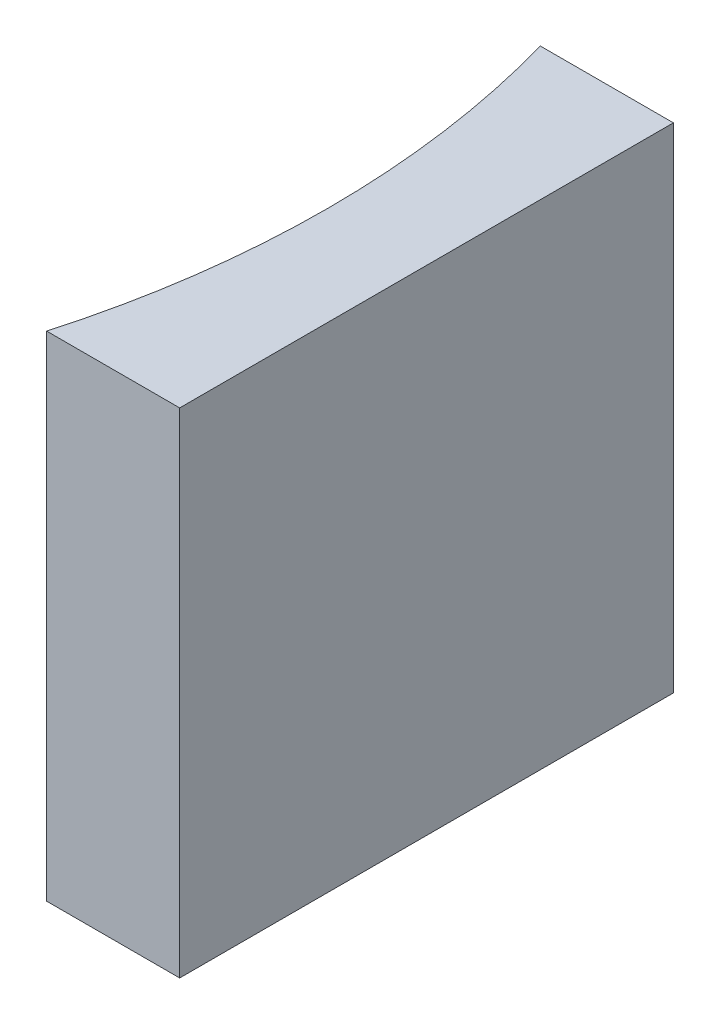
ISO-10303-21;
HEADER;
FILE_DESCRIPTION(('STEP AP214'),'2;1');
FILE_NAME('part.step','',(''),(''),'','','');
FILE_SCHEMA(('AUTOMOTIVE_DESIGN { 1 0 10303 214 1 1 1 1 }'));
ENDSEC;
DATA;
#1=APPLICATION_CONTEXT('core data for automotive mechanical design processes');
#2=APPLICATION_PROTOCOL_DEFINITION('international standard','automotive_design',2000,#1);
#3=PRODUCT_CONTEXT('',#1,'mechanical');
#4=PRODUCT('Part','Part','',(#3));
#5=PRODUCT_RELATED_PRODUCT_CATEGORY('part','',(#4));
#6=PRODUCT_DEFINITION_FORMATION('','',#4);
#7=PRODUCT_DEFINITION_CONTEXT('part definition',#1,'design');
#8=PRODUCT_DEFINITION('design','',#6,#7);
#9=PRODUCT_DEFINITION_SHAPE('','',#8);
#10=(LENGTH_UNIT() NAMED_UNIT(*) SI_UNIT(.MILLI.,.METRE.));
#11=(NAMED_UNIT(*) PLANE_ANGLE_UNIT() SI_UNIT($,.RADIAN.));
#12=(NAMED_UNIT(*) SI_UNIT($,.STERADIAN.) SOLID_ANGLE_UNIT());
#13=UNCERTAINTY_MEASURE_WITH_UNIT(LENGTH_MEASURE(1.E-05),#10,'distance_accuracy_value','');
#14=(GEOMETRIC_REPRESENTATION_CONTEXT(3) GLOBAL_UNCERTAINTY_ASSIGNED_CONTEXT((#13)) GLOBAL_UNIT_ASSIGNED_CONTEXT((#10,
#11,#12)) REPRESENTATION_CONTEXT('',''));
#15=CARTESIAN_POINT('',(0.,0.,0.));
#16=DIRECTION('',(0.,0.,1.));
#17=DIRECTION('',(1.,0.,0.));
#18=AXIS2_PLACEMENT_3D('',#15,#16,#17);
#19=CARTESIAN_POINT('',(0.,10.,0.));
#20=DIRECTION('',(0.,0.,1.));
#21=DIRECTION('',(1.,0.,0.));
#22=AXIS2_PLACEMENT_3D('',#19,#20,#21);
#23=PLANE('',#22);
#24=DIRECTION('',(-1.,0.,0.));
#25=VECTOR('',#24,1.);
#26=CARTESIAN_POINT('',(0.,0.,0.));
#27=LINE('',#26,#25);
#28=CARTESIAN_POINT('',(0.,0.,0.));
#29=VERTEX_POINT('',#28);
#30=CARTESIAN_POINT('',(-2.69551702886011,0.,0.));
#31=VERTEX_POINT('',#30);
#32=EDGE_CURVE('E98',#29,#31,#27,.T.);
#33=ORIENTED_EDGE('',*,*,#32,.T.);
#34=DIRECTION('',(0.,-1.,0.));
#35=VECTOR('',#34,1.);
#36=CARTESIAN_POINT('',(-2.69551702886011,10.,0.));
#37=LINE('',#36,#35);
#38=CARTESIAN_POINT('',(-2.69551702886011,10.,0.));
#39=VERTEX_POINT('',#38);
#40=EDGE_CURVE('E11',#39,#31,#37,.T.);
#41=ORIENTED_EDGE('',*,*,#40,.F.);
#42=DIRECTION('',(-1.,0.,0.));
#43=VECTOR('',#42,1.);
#44=CARTESIAN_POINT('',(0.,10.,0.));
#45=LINE('',#44,#43);
#46=CARTESIAN_POINT('',(0.,10.,0.));
#47=VERTEX_POINT('',#46);
#48=EDGE_CURVE('E86',#47,#39,#45,.T.);
#49=ORIENTED_EDGE('',*,*,#48,.F.);
#50=DIRECTION('',(0.,-1.,0.));
#51=VECTOR('',#50,1.);
#52=CARTESIAN_POINT('',(0.,10.,0.));
#53=LINE('',#52,#51);
#54=EDGE_CURVE('E94',#47,#29,#53,.T.);
#55=ORIENTED_EDGE('',*,*,#54,.T.);
#56=EDGE_LOOP('',(#33,#41,#49,#55));
#57=FACE_BOUND('',#56,.T.);
#58=ADVANCED_FACE('F35',(#57),#23,.F.);
#59=CARTESIAN_POINT('',(-20.32,10.,5.));
#60=DIRECTION('',(0.,-1.,0.));
#61=DIRECTION('',(0.,0.,-1.));
#62=AXIS2_PLACEMENT_3D('',#59,#60,#61);
#63=CYLINDRICAL_SURFACE('',#62,18.32);
#64=CARTESIAN_POINT('',(-20.32,0.,5.));
#65=DIRECTION('',(0.,-1.,0.));
#66=DIRECTION('',(0.,0.,1.));
#67=AXIS2_PLACEMENT_3D('',#64,#65,#66);
#68=CIRCLE('',#67,18.32);
#69=CARTESIAN_POINT('',(-2.69551702886011,0.,10.));
#70=VERTEX_POINT('',#69);
#71=EDGE_CURVE('E90',#31,#70,#68,.T.);
#72=ORIENTED_EDGE('',*,*,#71,.T.);
#73=DIRECTION('',(0.,-1.,0.));
#74=VECTOR('',#73,1.);
#75=CARTESIAN_POINT('',(-2.69551702886011,10.,10.));
#76=LINE('',#75,#74);
#77=CARTESIAN_POINT('',(-2.69551702886011,10.,10.));
#78=VERTEX_POINT('',#77);
#79=EDGE_CURVE('E43',#78,#70,#76,.T.);
#80=ORIENTED_EDGE('',*,*,#79,.F.);
#81=CARTESIAN_POINT('',(-20.32,10.,5.));
#82=DIRECTION('',(0.,-1.,0.));
#83=DIRECTION('',(0.,0.,1.));
#84=AXIS2_PLACEMENT_3D('',#81,#82,#83);
#85=CIRCLE('',#84,18.32);
#86=EDGE_CURVE('E81',#39,#78,#85,.T.);
#87=ORIENTED_EDGE('',*,*,#86,.F.);
#88=ORIENTED_EDGE('',*,*,#40,.T.);
#89=EDGE_LOOP('',(#72,#80,#87,#88));
#90=FACE_BOUND('',#89,.T.);
#91=ADVANCED_FACE('F89',(#90),#63,.F.);
#92=CARTESIAN_POINT('',(0.,10.,10.));
#93=DIRECTION('',(0.,0.,-1.));
#94=DIRECTION('',(-1.,0.,0.));
#95=AXIS2_PLACEMENT_3D('',#92,#93,#94);
#96=PLANE('',#95);
#97=DIRECTION('',(1.,0.,0.));
#98=VECTOR('',#97,1.);
#99=CARTESIAN_POINT('',(0.,0.,10.));
#100=LINE('',#99,#98);
#101=CARTESIAN_POINT('',(0.,0.,10.));
#102=VERTEX_POINT('',#101);
#103=EDGE_CURVE('E68',#70,#102,#100,.T.);
#104=ORIENTED_EDGE('',*,*,#103,.T.);
#105=DIRECTION('',(0.,-1.,0.));
#106=VECTOR('',#105,1.);
#107=CARTESIAN_POINT('',(0.,10.,10.));
#108=LINE('',#107,#106);
#109=CARTESIAN_POINT('',(0.,10.,10.));
#110=VERTEX_POINT('',#109);
#111=EDGE_CURVE('E91',#110,#102,#108,.T.);
#112=ORIENTED_EDGE('',*,*,#111,.F.);
#113=DIRECTION('',(1.,0.,0.));
#114=VECTOR('',#113,1.);
#115=CARTESIAN_POINT('',(0.,10.,10.));
#116=LINE('',#115,#114);
#117=EDGE_CURVE('E84',#78,#110,#116,.T.);
#118=ORIENTED_EDGE('',*,*,#117,.F.);
#119=ORIENTED_EDGE('',*,*,#79,.T.);
#120=EDGE_LOOP('',(#104,#112,#118,#119));
#121=FACE_BOUND('',#120,.T.);
#122=ADVANCED_FACE('F92',(#121),#96,.F.);
#123=CARTESIAN_POINT('',(0.,10.,0.));
#124=DIRECTION('',(-1.,0.,0.));
#125=DIRECTION('',(0.,0.,1.));
#126=AXIS2_PLACEMENT_3D('',#123,#124,#125);
#127=PLANE('',#126);
#128=DIRECTION('',(0.,0.,-1.));
#129=VECTOR('',#128,1.);
#130=CARTESIAN_POINT('',(0.,0.,0.));
#131=LINE('',#130,#129);
#132=EDGE_CURVE('E74',#102,#29,#131,.T.);
#133=ORIENTED_EDGE('',*,*,#132,.T.);
#134=ORIENTED_EDGE('',*,*,#54,.F.);
#135=DIRECTION('',(0.,0.,-1.));
#136=VECTOR('',#135,1.);
#137=CARTESIAN_POINT('',(0.,10.,0.));
#138=LINE('',#137,#136);
#139=EDGE_CURVE('E51',#110,#47,#138,.T.);
#140=ORIENTED_EDGE('',*,*,#139,.F.);
#141=ORIENTED_EDGE('',*,*,#111,.T.);
#142=EDGE_LOOP('',(#133,#134,#140,#141));
#143=FACE_BOUND('',#142,.T.);
#144=ADVANCED_FACE('F105',(#143),#127,.F.);
#145=CARTESIAN_POINT('',(-20.32,10.,5.));
#146=DIRECTION('',(0.,1.,0.));
#147=DIRECTION('',(0.,0.,1.));
#148=AXIS2_PLACEMENT_3D('',#145,#146,#147);
#149=PLANE('',#148);
#150=ORIENTED_EDGE('',*,*,#48,.T.);
#151=ORIENTED_EDGE('',*,*,#86,.T.);
#152=ORIENTED_EDGE('',*,*,#117,.T.);
#153=ORIENTED_EDGE('',*,*,#139,.T.);
#154=EDGE_LOOP('',(#150,#151,#152,#153));
#155=FACE_BOUND('',#154,.T.);
#156=ADVANCED_FACE('F82',(#155),#149,.T.);
#157=CARTESIAN_POINT('',(-20.32,0.,5.));
#158=DIRECTION('',(0.,1.,0.));
#159=DIRECTION('',(0.,0.,1.));
#160=AXIS2_PLACEMENT_3D('',#157,#158,#159);
#161=PLANE('',#160);
#162=ORIENTED_EDGE('',*,*,#32,.F.);
#163=ORIENTED_EDGE('',*,*,#132,.F.);
#164=ORIENTED_EDGE('',*,*,#103,.F.);
#165=ORIENTED_EDGE('',*,*,#71,.F.);
#166=EDGE_LOOP('',(#162,#163,#164,#165));
#167=FACE_BOUND('',#166,.T.);
#168=ADVANCED_FACE('F108',(#167),#161,.F.);
#169=CLOSED_SHELL('',(#58,#91,#122,#144,#156,#168));
#170=MANIFOLD_SOLID_BREP('B2',#169);
#171=ADVANCED_BREP_SHAPE_REPRESENTATION('',(#18,#170),#14);
#172=SHAPE_DEFINITION_REPRESENTATION(#9,#171);
ENDSEC;
END-ISO-10303-21;
